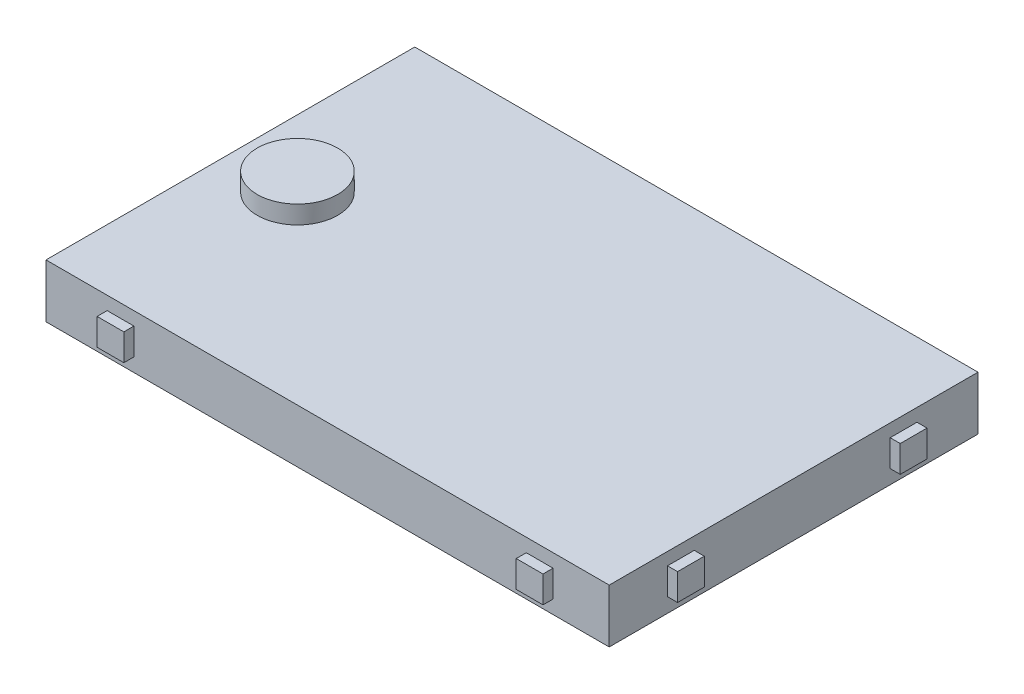
ISO-10303-21;
HEADER;
FILE_DESCRIPTION(('STEP AP214'),'2;1');
FILE_NAME('part.step','',(''),(''),'','','');
FILE_SCHEMA(('AUTOMOTIVE_DESIGN { 1 0 10303 214 1 1 1 1 }'));
ENDSEC;
DATA;
#1=APPLICATION_CONTEXT('core data for automotive mechanical design processes');
#2=APPLICATION_PROTOCOL_DEFINITION('international standard','automotive_design',2000,#1);
#3=PRODUCT_CONTEXT('',#1,'mechanical');
#4=PRODUCT('Part','Part','',(#3));
#5=PRODUCT_RELATED_PRODUCT_CATEGORY('part','',(#4));
#6=PRODUCT_DEFINITION_FORMATION('','',#4);
#7=PRODUCT_DEFINITION_CONTEXT('part definition',#1,'design');
#8=PRODUCT_DEFINITION('design','',#6,#7);
#9=PRODUCT_DEFINITION_SHAPE('','',#8);
#10=(LENGTH_UNIT() NAMED_UNIT(*) SI_UNIT(.MILLI.,.METRE.));
#11=(NAMED_UNIT(*) PLANE_ANGLE_UNIT() SI_UNIT($,.RADIAN.));
#12=(NAMED_UNIT(*) SI_UNIT($,.STERADIAN.) SOLID_ANGLE_UNIT());
#13=UNCERTAINTY_MEASURE_WITH_UNIT(LENGTH_MEASURE(1.E-05),#10,'distance_accuracy_value','');
#14=(GEOMETRIC_REPRESENTATION_CONTEXT(3) GLOBAL_UNCERTAINTY_ASSIGNED_CONTEXT((#13)) GLOBAL_UNIT_ASSIGNED_CONTEXT((#10,
#11,#12)) REPRESENTATION_CONTEXT('',''));
#15=CARTESIAN_POINT('',(0.,0.,0.));
#16=DIRECTION('',(0.,0.,1.));
#17=DIRECTION('',(1.,0.,0.));
#18=AXIS2_PLACEMENT_3D('',#15,#16,#17);
#19=CARTESIAN_POINT('',(42.,8.,27.5));
#20=DIRECTION('',(-1.,0.,0.));
#21=DIRECTION('',(0.,0.,1.));
#22=AXIS2_PLACEMENT_3D('',#19,#20,#21);
#23=PLANE('',#22);
#24=DIRECTION('',(0.,-1.,0.));
#25=VECTOR('',#24,1.);
#26=CARTESIAN_POINT('',(42.,2.15041551653368,18.8064806718478));
#27=LINE('',#26,#25);
#28=CARTESIAN_POINT('',(42.,6.14041551653368,18.8064806718478));
#29=VERTEX_POINT('',#28);
#30=CARTESIAN_POINT('',(42.,2.15041551653368,18.8064806718478));
#31=VERTEX_POINT('',#30);
#32=EDGE_CURVE('E204',#29,#31,#27,.T.);
#33=ORIENTED_EDGE('',*,*,#32,.F.);
#34=DIRECTION('',(0.,0.,1.));
#35=VECTOR('',#34,1.);
#36=CARTESIAN_POINT('',(42.,6.14041551653368,14.8164806718478));
#37=LINE('',#36,#35);
#38=CARTESIAN_POINT('',(42.,6.14041551653368,14.8164806718478));
#39=VERTEX_POINT('',#38);
#40=EDGE_CURVE('E220',#39,#29,#37,.T.);
#41=ORIENTED_EDGE('',*,*,#40,.F.);
#42=DIRECTION('',(0.,1.,0.));
#43=VECTOR('',#42,1.);
#44=CARTESIAN_POINT('',(42.,2.15041551653368,14.8164806718478));
#45=LINE('',#44,#43);
#46=CARTESIAN_POINT('',(42.,2.15041551653368,14.8164806718478));
#47=VERTEX_POINT('',#46);
#48=EDGE_CURVE('E233',#47,#39,#45,.T.);
#49=ORIENTED_EDGE('',*,*,#48,.F.);
#50=DIRECTION('',(0.,0.,-1.));
#51=VECTOR('',#50,1.);
#52=CARTESIAN_POINT('',(42.,2.15041551653368,14.8164806718478));
#53=LINE('',#52,#51);
#54=EDGE_CURVE('E209',#31,#47,#53,.T.);
#55=ORIENTED_EDGE('',*,*,#54,.F.);
#56=EDGE_LOOP('',(#33,#41,#49,#55));
#57=FACE_BOUND('',#56,.T.);
#58=DIRECTION('',(0.,0.,-1.));
#59=VECTOR('',#58,1.);
#60=CARTESIAN_POINT('',(42.,0.,27.5));
#61=LINE('',#60,#59);
#62=CARTESIAN_POINT('',(42.,0.,27.5));
#63=VERTEX_POINT('',#62);
#64=CARTESIAN_POINT('',(42.,0.,-27.5));
#65=VERTEX_POINT('',#64);
#66=EDGE_CURVE('E345',#63,#65,#61,.T.);
#67=ORIENTED_EDGE('',*,*,#66,.T.);
#68=DIRECTION('',(0.,-1.,0.));
#69=VECTOR('',#68,1.);
#70=CARTESIAN_POINT('',(42.,8.,-27.5));
#71=LINE('',#70,#69);
#72=CARTESIAN_POINT('',(42.,8.,-27.5));
#73=VERTEX_POINT('',#72);
#74=EDGE_CURVE('E51',#73,#65,#71,.T.);
#75=ORIENTED_EDGE('',*,*,#74,.F.);
#76=DIRECTION('',(0.,0.,-1.));
#77=VECTOR('',#76,1.);
#78=CARTESIAN_POINT('',(42.,8.,27.5));
#79=LINE('',#78,#77);
#80=CARTESIAN_POINT('',(42.,8.,27.5));
#81=VERTEX_POINT('',#80);
#82=EDGE_CURVE('E346',#81,#73,#79,.T.);
#83=ORIENTED_EDGE('',*,*,#82,.F.);
#84=DIRECTION('',(0.,-1.,0.));
#85=VECTOR('',#84,1.);
#86=CARTESIAN_POINT('',(42.,8.,27.5));
#87=LINE('',#86,#85);
#88=EDGE_CURVE('E360',#81,#63,#87,.T.);
#89=ORIENTED_EDGE('',*,*,#88,.T.);
#90=EDGE_LOOP('',(#67,#75,#83,#89));
#91=FACE_BOUND('',#90,.T.);
#92=DIRECTION('',(0.,-1.,0.));
#93=VECTOR('',#92,1.);
#94=CARTESIAN_POINT('',(42.,2.09309308210614,-14.4034824494288));
#95=LINE('',#94,#93);
#96=CARTESIAN_POINT('',(42.,6.08309308210614,-14.4034824494288));
#97=VERTEX_POINT('',#96);
#98=CARTESIAN_POINT('',(42.,2.09309308210614,-14.4034824494288));
#99=VERTEX_POINT('',#98);
#100=EDGE_CURVE('E202',#97,#99,#95,.T.);
#101=ORIENTED_EDGE('',*,*,#100,.F.);
#102=DIRECTION('',(0.,0.,1.));
#103=VECTOR('',#102,1.);
#104=CARTESIAN_POINT('',(42.,6.08309308210614,-18.3934824494288));
#105=LINE('',#104,#103);
#106=CARTESIAN_POINT('',(42.,6.08309308210614,-18.3934824494288));
#107=VERTEX_POINT('',#106);
#108=EDGE_CURVE('E199',#107,#97,#105,.T.);
#109=ORIENTED_EDGE('',*,*,#108,.F.);
#110=DIRECTION('',(0.,1.,0.));
#111=VECTOR('',#110,1.);
#112=CARTESIAN_POINT('',(42.,2.09309308210614,-18.3934824494288));
#113=LINE('',#112,#111);
#114=CARTESIAN_POINT('',(42.,2.09309308210614,-18.3934824494288));
#115=VERTEX_POINT('',#114);
#116=EDGE_CURVE('E63',#115,#107,#113,.T.);
#117=ORIENTED_EDGE('',*,*,#116,.F.);
#118=DIRECTION('',(0.,0.,-1.));
#119=VECTOR('',#118,1.);
#120=CARTESIAN_POINT('',(42.,2.09309308210614,-18.3934824494288));
#121=LINE('',#120,#119);
#122=EDGE_CURVE('E58',#99,#115,#121,.T.);
#123=ORIENTED_EDGE('',*,*,#122,.F.);
#124=EDGE_LOOP('',(#101,#109,#117,#123));
#125=FACE_BOUND('',#124,.T.);
#126=ADVANCED_FACE('F43',(#57,#91,#125),#23,.F.);
#127=CARTESIAN_POINT('',(-42.,8.,27.5));
#128=DIRECTION('',(0.,0.,-1.));
#129=DIRECTION('',(-1.,0.,0.));
#130=AXIS2_PLACEMENT_3D('',#127,#128,#129);
#131=PLANE('',#130);
#132=DIRECTION('',(0.,-1.,0.));
#133=VECTOR('',#132,1.);
#134=CARTESIAN_POINT('',(-32.8782129241059,2.02252596258467,27.5));
#135=LINE('',#134,#133);
#136=CARTESIAN_POINT('',(-32.8782129241059,6.00979932485183,27.5));
#137=VERTEX_POINT('',#136);
#138=CARTESIAN_POINT('',(-32.8782129241059,2.02252596258467,27.5));
#139=VERTEX_POINT('',#138);
#140=EDGE_CURVE('E300',#137,#139,#135,.T.);
#141=ORIENTED_EDGE('',*,*,#140,.F.);
#142=DIRECTION('',(-1.,0.,0.));
#143=VECTOR('',#142,1.);
#144=CARTESIAN_POINT('',(-28.8909395618387,6.00979932485183,27.5));
#145=LINE('',#144,#143);
#146=CARTESIAN_POINT('',(-28.8909395618387,6.00979932485183,27.5));
#147=VERTEX_POINT('',#146);
#148=EDGE_CURVE('E306',#147,#137,#145,.T.);
#149=ORIENTED_EDGE('',*,*,#148,.F.);
#150=DIRECTION('',(0.,1.,0.));
#151=VECTOR('',#150,1.);
#152=CARTESIAN_POINT('',(-28.8909395618387,2.02252596258467,27.5));
#153=LINE('',#152,#151);
#154=CARTESIAN_POINT('',(-28.8909395618387,2.02252596258467,27.5));
#155=VERTEX_POINT('',#154);
#156=EDGE_CURVE('E323',#155,#147,#153,.T.);
#157=ORIENTED_EDGE('',*,*,#156,.F.);
#158=DIRECTION('',(1.,0.,0.));
#159=VECTOR('',#158,1.);
#160=CARTESIAN_POINT('',(-28.8909395618387,2.02252596258467,27.5));
#161=LINE('',#160,#159);
#162=EDGE_CURVE('E319',#139,#155,#161,.T.);
#163=ORIENTED_EDGE('',*,*,#162,.F.);
#164=EDGE_LOOP('',(#141,#149,#157,#163));
#165=FACE_BOUND('',#164,.T.);
#166=DIRECTION('',(1.,0.,0.));
#167=VECTOR('',#166,1.);
#168=CARTESIAN_POINT('',(-42.,0.,27.5));
#169=LINE('',#168,#167);
#170=CARTESIAN_POINT('',(-42.,0.,27.5));
#171=VERTEX_POINT('',#170);
#172=EDGE_CURVE('E351',#171,#63,#169,.T.);
#173=ORIENTED_EDGE('',*,*,#172,.T.);
#174=ORIENTED_EDGE('',*,*,#88,.F.);
#175=DIRECTION('',(1.,0.,0.));
#176=VECTOR('',#175,1.);
#177=CARTESIAN_POINT('',(-42.,8.,27.5));
#178=LINE('',#177,#176);
#179=CARTESIAN_POINT('',(-42.,8.,27.5));
#180=VERTEX_POINT('',#179);
#181=EDGE_CURVE('E357',#180,#81,#178,.T.);
#182=ORIENTED_EDGE('',*,*,#181,.F.);
#183=DIRECTION('',(0.,-1.,0.));
#184=VECTOR('',#183,1.);
#185=CARTESIAN_POINT('',(-42.,8.,27.5));
#186=LINE('',#185,#184);
#187=EDGE_CURVE('E375',#180,#171,#186,.T.);
#188=ORIENTED_EDGE('',*,*,#187,.T.);
#189=EDGE_LOOP('',(#173,#174,#182,#188));
#190=FACE_BOUND('',#189,.T.);
#191=DIRECTION('',(0.,-1.,0.));
#192=VECTOR('',#191,1.);
#193=CARTESIAN_POINT('',(29.6326906695763,2.00394113546741,27.5));
#194=LINE('',#193,#192);
#195=CARTESIAN_POINT('',(29.6326906695763,5.99394113546741,27.5));
#196=VERTEX_POINT('',#195);
#197=CARTESIAN_POINT('',(29.6326906695763,2.00394113546741,27.5));
#198=VERTEX_POINT('',#197);
#199=EDGE_CURVE('E255',#196,#198,#194,.T.);
#200=ORIENTED_EDGE('',*,*,#199,.F.);
#201=DIRECTION('',(-1.,0.,0.));
#202=VECTOR('',#201,1.);
#203=CARTESIAN_POINT('',(33.6226906695763,5.99394113546741,27.5));
#204=LINE('',#203,#202);
#205=CARTESIAN_POINT('',(33.6226906695763,5.99394113546741,27.5));
#206=VERTEX_POINT('',#205);
#207=EDGE_CURVE('E261',#206,#196,#204,.T.);
#208=ORIENTED_EDGE('',*,*,#207,.F.);
#209=DIRECTION('',(0.,1.,0.));
#210=VECTOR('',#209,1.);
#211=CARTESIAN_POINT('',(33.6226906695763,2.00394113546741,27.5));
#212=LINE('',#211,#210);
#213=CARTESIAN_POINT('',(33.6226906695763,2.00394113546741,27.5));
#214=VERTEX_POINT('',#213);
#215=EDGE_CURVE('E278',#214,#206,#212,.T.);
#216=ORIENTED_EDGE('',*,*,#215,.F.);
#217=DIRECTION('',(1.,0.,0.));
#218=VECTOR('',#217,1.);
#219=CARTESIAN_POINT('',(33.6226906695763,2.00394113546741,27.5));
#220=LINE('',#219,#218);
#221=EDGE_CURVE('E274',#198,#214,#220,.T.);
#222=ORIENTED_EDGE('',*,*,#221,.F.);
#223=EDGE_LOOP('',(#200,#208,#216,#222));
#224=FACE_BOUND('',#223,.T.);
#225=ADVANCED_FACE('F402',(#165,#190,#224),#131,.F.);
#226=CARTESIAN_POINT('',(-42.,8.,-27.5));
#227=DIRECTION('',(0.,0.,1.));
#228=DIRECTION('',(1.,0.,0.));
#229=AXIS2_PLACEMENT_3D('',#226,#227,#228);
#230=PLANE('',#229);
#231=DIRECTION('',(-1.,0.,0.));
#232=VECTOR('',#231,1.);
#233=CARTESIAN_POINT('',(-42.,0.,-27.5));
#234=LINE('',#233,#232);
#235=CARTESIAN_POINT('',(-42.,0.,-27.5));
#236=VERTEX_POINT('',#235);
#237=EDGE_CURVE('E364',#65,#236,#234,.T.);
#238=ORIENTED_EDGE('',*,*,#237,.T.);
#239=DIRECTION('',(0.,-1.,0.));
#240=VECTOR('',#239,1.);
#241=CARTESIAN_POINT('',(-42.,8.,-27.5));
#242=LINE('',#241,#240);
#243=CARTESIAN_POINT('',(-42.,8.,-27.5));
#244=VERTEX_POINT('',#243);
#245=EDGE_CURVE('E379',#244,#236,#242,.T.);
#246=ORIENTED_EDGE('',*,*,#245,.F.);
#247=DIRECTION('',(-1.,0.,0.));
#248=VECTOR('',#247,1.);
#249=CARTESIAN_POINT('',(-42.,8.,-27.5));
#250=LINE('',#249,#248);
#251=EDGE_CURVE('E350',#73,#244,#250,.T.);
#252=ORIENTED_EDGE('',*,*,#251,.F.);
#253=ORIENTED_EDGE('',*,*,#74,.T.);
#254=EDGE_LOOP('',(#238,#246,#252,#253));
#255=FACE_BOUND('',#254,.T.);
#256=ADVANCED_FACE('F386',(#255),#230,.F.);
#257=CARTESIAN_POINT('',(-42.,8.,27.5));
#258=DIRECTION('',(1.,0.,0.));
#259=DIRECTION('',(0.,0.,-1.));
#260=AXIS2_PLACEMENT_3D('',#257,#258,#259);
#261=PLANE('',#260);
#262=DIRECTION('',(0.,0.,1.));
#263=VECTOR('',#262,1.);
#264=CARTESIAN_POINT('',(-42.,0.,27.5));
#265=LINE('',#264,#263);
#266=EDGE_CURVE('E367',#236,#171,#265,.T.);
#267=ORIENTED_EDGE('',*,*,#266,.T.);
#268=ORIENTED_EDGE('',*,*,#187,.F.);
#269=DIRECTION('',(0.,0.,1.));
#270=VECTOR('',#269,1.);
#271=CARTESIAN_POINT('',(-42.,8.,27.5));
#272=LINE('',#271,#270);
#273=EDGE_CURVE('E354',#244,#180,#272,.T.);
#274=ORIENTED_EDGE('',*,*,#273,.F.);
#275=ORIENTED_EDGE('',*,*,#245,.T.);
#276=EDGE_LOOP('',(#267,#268,#274,#275));
#277=FACE_BOUND('',#276,.T.);
#278=ADVANCED_FACE('F398',(#277),#261,.F.);
#279=CARTESIAN_POINT('',(0.,8.,0.));
#280=DIRECTION('',(0.,-1.,0.));
#281=DIRECTION('',(0.,0.,-1.));
#282=AXIS2_PLACEMENT_3D('',#279,#280,#281);
#283=PLANE('',#282);
#284=CARTESIAN_POINT('',(-32.,8.,0.));
#285=DIRECTION('',(0.,-1.,0.));
#286=DIRECTION('',(0.,0.,-1.));
#287=AXIS2_PLACEMENT_3D('',#284,#285,#286);
#288=CIRCLE('',#287,6.);
#289=CARTESIAN_POINT('',(-32.,8.,-6.));
#290=VERTEX_POINT('',#289);
#291=EDGE_CURVE('E11',#290,#290,#288,.F.);
#292=ORIENTED_EDGE('',*,*,#291,.F.);
#293=EDGE_LOOP('',(#292));
#294=FACE_BOUND('',#293,.T.);
#295=ORIENTED_EDGE('',*,*,#82,.T.);
#296=ORIENTED_EDGE('',*,*,#251,.T.);
#297=ORIENTED_EDGE('',*,*,#273,.T.);
#298=ORIENTED_EDGE('',*,*,#181,.T.);
#299=EDGE_LOOP('',(#295,#296,#297,#298));
#300=FACE_BOUND('',#299,.T.);
#301=ADVANCED_FACE('F405',(#294,#300),#283,.F.);
#302=CARTESIAN_POINT('',(0.,0.,0.));
#303=DIRECTION('',(0.,-1.,0.));
#304=DIRECTION('',(0.,0.,-1.));
#305=AXIS2_PLACEMENT_3D('',#302,#303,#304);
#306=PLANE('',#305);
#307=ORIENTED_EDGE('',*,*,#66,.F.);
#308=ORIENTED_EDGE('',*,*,#172,.F.);
#309=ORIENTED_EDGE('',*,*,#266,.F.);
#310=ORIENTED_EDGE('',*,*,#237,.F.);
#311=EDGE_LOOP('',(#307,#308,#309,#310));
#312=FACE_BOUND('',#311,.T.);
#313=ADVANCED_FACE('F394',(#312),#306,.T.);
#314=CARTESIAN_POINT('',(-32.8782129241059,2.02252596258467,29.));
#315=DIRECTION('',(1.,0.,0.));
#316=DIRECTION('',(0.,0.,-1.));
#317=AXIS2_PLACEMENT_3D('',#314,#315,#316);
#318=PLANE('',#317);
#319=ORIENTED_EDGE('',*,*,#140,.T.);
#320=DIRECTION('',(0.,0.,-1.));
#321=VECTOR('',#320,1.);
#322=CARTESIAN_POINT('',(-32.8782129241059,2.02252596258467,29.));
#323=LINE('',#322,#321);
#324=CARTESIAN_POINT('',(-32.8782129241059,2.02252596258467,29.));
#325=VERTEX_POINT('',#324);
#326=EDGE_CURVE('E341',#325,#139,#323,.T.);
#327=ORIENTED_EDGE('',*,*,#326,.F.);
#328=DIRECTION('',(0.,-1.,0.));
#329=VECTOR('',#328,1.);
#330=CARTESIAN_POINT('',(-32.8782129241059,2.02252596258467,29.));
#331=LINE('',#330,#329);
#332=CARTESIAN_POINT('',(-32.8782129241059,6.00979932485183,29.));
#333=VERTEX_POINT('',#332);
#334=EDGE_CURVE('E301',#333,#325,#331,.T.);
#335=ORIENTED_EDGE('',*,*,#334,.F.);
#336=DIRECTION('',(0.,0.,-1.));
#337=VECTOR('',#336,1.);
#338=CARTESIAN_POINT('',(-32.8782129241059,6.00979932485183,29.));
#339=LINE('',#338,#337);
#340=EDGE_CURVE('E315',#333,#137,#339,.T.);
#341=ORIENTED_EDGE('',*,*,#340,.T.);
#342=EDGE_LOOP('',(#319,#327,#335,#341));
#343=FACE_BOUND('',#342,.T.);
#344=ADVANCED_FACE('F414',(#343),#318,.F.);
#345=CARTESIAN_POINT('',(-28.8909395618387,2.02252596258467,29.));
#346=DIRECTION('',(0.,1.,0.));
#347=DIRECTION('',(-1.,0.,0.));
#348=AXIS2_PLACEMENT_3D('',#345,#346,#347);
#349=PLANE('',#348);
#350=ORIENTED_EDGE('',*,*,#162,.T.);
#351=DIRECTION('',(0.,0.,-1.));
#352=VECTOR('',#351,1.);
#353=CARTESIAN_POINT('',(-28.8909395618387,2.02252596258467,29.));
#354=LINE('',#353,#352);
#355=CARTESIAN_POINT('',(-28.8909395618387,2.02252596258467,29.));
#356=VERTEX_POINT('',#355);
#357=EDGE_CURVE('E337',#356,#155,#354,.T.);
#358=ORIENTED_EDGE('',*,*,#357,.F.);
#359=DIRECTION('',(1.,0.,0.));
#360=VECTOR('',#359,1.);
#361=CARTESIAN_POINT('',(-28.8909395618387,2.02252596258467,29.));
#362=LINE('',#361,#360);
#363=EDGE_CURVE('E305',#325,#356,#362,.T.);
#364=ORIENTED_EDGE('',*,*,#363,.F.);
#365=ORIENTED_EDGE('',*,*,#326,.T.);
#366=EDGE_LOOP('',(#350,#358,#364,#365));
#367=FACE_BOUND('',#366,.T.);
#368=ADVANCED_FACE('F485',(#367),#349,.F.);
#369=CARTESIAN_POINT('',(-28.8909395618387,2.02252596258467,29.));
#370=DIRECTION('',(-1.,0.,0.));
#371=DIRECTION('',(0.,0.,1.));
#372=AXIS2_PLACEMENT_3D('',#369,#370,#371);
#373=PLANE('',#372);
#374=ORIENTED_EDGE('',*,*,#156,.T.);
#375=DIRECTION('',(0.,0.,-1.));
#376=VECTOR('',#375,1.);
#377=CARTESIAN_POINT('',(-28.8909395618387,6.00979932485183,29.));
#378=LINE('',#377,#376);
#379=CARTESIAN_POINT('',(-28.8909395618387,6.00979932485183,29.));
#380=VERTEX_POINT('',#379);
#381=EDGE_CURVE('E333',#380,#147,#378,.T.);
#382=ORIENTED_EDGE('',*,*,#381,.F.);
#383=DIRECTION('',(0.,1.,0.));
#384=VECTOR('',#383,1.);
#385=CARTESIAN_POINT('',(-28.8909395618387,2.02252596258467,29.));
#386=LINE('',#385,#384);
#387=EDGE_CURVE('E309',#356,#380,#386,.T.);
#388=ORIENTED_EDGE('',*,*,#387,.F.);
#389=ORIENTED_EDGE('',*,*,#357,.T.);
#390=EDGE_LOOP('',(#374,#382,#388,#389));
#391=FACE_BOUND('',#390,.T.);
#392=ADVANCED_FACE('F481',(#391),#373,.F.);
#393=CARTESIAN_POINT('',(-28.8909395618387,6.00979932485183,29.));
#394=DIRECTION('',(0.,-1.,0.));
#395=DIRECTION('',(1.,0.,0.));
#396=AXIS2_PLACEMENT_3D('',#393,#394,#395);
#397=PLANE('',#396);
#398=ORIENTED_EDGE('',*,*,#148,.T.);
#399=ORIENTED_EDGE('',*,*,#340,.F.);
#400=DIRECTION('',(-1.,0.,0.));
#401=VECTOR('',#400,1.);
#402=CARTESIAN_POINT('',(-28.8909395618387,6.00979932485183,29.));
#403=LINE('',#402,#401);
#404=EDGE_CURVE('E312',#380,#333,#403,.T.);
#405=ORIENTED_EDGE('',*,*,#404,.F.);
#406=ORIENTED_EDGE('',*,*,#381,.T.);
#407=EDGE_LOOP('',(#398,#399,#405,#406));
#408=FACE_BOUND('',#407,.T.);
#409=ADVANCED_FACE('F477',(#408),#397,.F.);
#410=CARTESIAN_POINT('',(0.,0.,29.));
#411=DIRECTION('',(0.,0.,1.));
#412=DIRECTION('',(1.,0.,0.));
#413=AXIS2_PLACEMENT_3D('',#410,#411,#412);
#414=PLANE('',#413);
#415=ORIENTED_EDGE('',*,*,#334,.T.);
#416=ORIENTED_EDGE('',*,*,#363,.T.);
#417=ORIENTED_EDGE('',*,*,#387,.T.);
#418=ORIENTED_EDGE('',*,*,#404,.T.);
#419=EDGE_LOOP('',(#415,#416,#417,#418));
#420=FACE_BOUND('',#419,.T.);
#421=ADVANCED_FACE('F473',(#420),#414,.T.);
#422=CARTESIAN_POINT('',(29.6326906695763,2.00394113546741,29.));
#423=DIRECTION('',(1.,0.,0.));
#424=DIRECTION('',(0.,0.,-1.));
#425=AXIS2_PLACEMENT_3D('',#422,#423,#424);
#426=PLANE('',#425);
#427=ORIENTED_EDGE('',*,*,#199,.T.);
#428=DIRECTION('',(0.,0.,-1.));
#429=VECTOR('',#428,1.);
#430=CARTESIAN_POINT('',(29.6326906695763,2.00394113546741,29.));
#431=LINE('',#430,#429);
#432=CARTESIAN_POINT('',(29.6326906695763,2.00394113546741,29.));
#433=VERTEX_POINT('',#432);
#434=EDGE_CURVE('E296',#433,#198,#431,.T.);
#435=ORIENTED_EDGE('',*,*,#434,.F.);
#436=DIRECTION('',(0.,-1.,0.));
#437=VECTOR('',#436,1.);
#438=CARTESIAN_POINT('',(29.6326906695763,2.00394113546741,29.));
#439=LINE('',#438,#437);
#440=CARTESIAN_POINT('',(29.6326906695763,5.99394113546741,29.));
#441=VERTEX_POINT('',#440);
#442=EDGE_CURVE('E256',#441,#433,#439,.T.);
#443=ORIENTED_EDGE('',*,*,#442,.F.);
#444=DIRECTION('',(0.,0.,-1.));
#445=VECTOR('',#444,1.);
#446=CARTESIAN_POINT('',(29.6326906695763,5.99394113546741,29.));
#447=LINE('',#446,#445);
#448=EDGE_CURVE('E270',#441,#196,#447,.T.);
#449=ORIENTED_EDGE('',*,*,#448,.T.);
#450=EDGE_LOOP('',(#427,#435,#443,#449));
#451=FACE_BOUND('',#450,.T.);
#452=ADVANCED_FACE('F469',(#451),#426,.F.);
#453=CARTESIAN_POINT('',(33.6226906695763,2.00394113546741,29.));
#454=DIRECTION('',(0.,1.,0.));
#455=DIRECTION('',(0.,0.,1.));
#456=AXIS2_PLACEMENT_3D('',#453,#454,#455);
#457=PLANE('',#456);
#458=ORIENTED_EDGE('',*,*,#221,.T.);
#459=DIRECTION('',(0.,0.,-1.));
#460=VECTOR('',#459,1.);
#461=CARTESIAN_POINT('',(33.6226906695763,2.00394113546741,29.));
#462=LINE('',#461,#460);
#463=CARTESIAN_POINT('',(33.6226906695763,2.00394113546741,29.));
#464=VERTEX_POINT('',#463);
#465=EDGE_CURVE('E292',#464,#214,#462,.T.);
#466=ORIENTED_EDGE('',*,*,#465,.F.);
#467=DIRECTION('',(1.,0.,0.));
#468=VECTOR('',#467,1.);
#469=CARTESIAN_POINT('',(33.6226906695763,2.00394113546741,29.));
#470=LINE('',#469,#468);
#471=EDGE_CURVE('E260',#433,#464,#470,.T.);
#472=ORIENTED_EDGE('',*,*,#471,.F.);
#473=ORIENTED_EDGE('',*,*,#434,.T.);
#474=EDGE_LOOP('',(#458,#466,#472,#473));
#475=FACE_BOUND('',#474,.T.);
#476=ADVANCED_FACE('F465',(#475),#457,.F.);
#477=CARTESIAN_POINT('',(33.6226906695763,2.00394113546741,29.));
#478=DIRECTION('',(-1.,0.,0.));
#479=DIRECTION('',(0.,-1.,0.));
#480=AXIS2_PLACEMENT_3D('',#477,#478,#479);
#481=PLANE('',#480);
#482=ORIENTED_EDGE('',*,*,#215,.T.);
#483=DIRECTION('',(0.,0.,-1.));
#484=VECTOR('',#483,1.);
#485=CARTESIAN_POINT('',(33.6226906695763,5.99394113546741,29.));
#486=LINE('',#485,#484);
#487=CARTESIAN_POINT('',(33.6226906695763,5.99394113546741,29.));
#488=VERTEX_POINT('',#487);
#489=EDGE_CURVE('E288',#488,#206,#486,.T.);
#490=ORIENTED_EDGE('',*,*,#489,.F.);
#491=DIRECTION('',(0.,1.,0.));
#492=VECTOR('',#491,1.);
#493=CARTESIAN_POINT('',(33.6226906695763,2.00394113546741,29.));
#494=LINE('',#493,#492);
#495=EDGE_CURVE('E264',#464,#488,#494,.T.);
#496=ORIENTED_EDGE('',*,*,#495,.F.);
#497=ORIENTED_EDGE('',*,*,#465,.T.);
#498=EDGE_LOOP('',(#482,#490,#496,#497));
#499=FACE_BOUND('',#498,.T.);
#500=ADVANCED_FACE('F461',(#499),#481,.F.);
#501=CARTESIAN_POINT('',(33.6226906695763,5.99394113546741,29.));
#502=DIRECTION('',(0.,-1.,0.));
#503=DIRECTION('',(0.,0.,-1.));
#504=AXIS2_PLACEMENT_3D('',#501,#502,#503);
#505=PLANE('',#504);
#506=ORIENTED_EDGE('',*,*,#207,.T.);
#507=ORIENTED_EDGE('',*,*,#448,.F.);
#508=DIRECTION('',(-1.,0.,0.));
#509=VECTOR('',#508,1.);
#510=CARTESIAN_POINT('',(33.6226906695763,5.99394113546741,29.));
#511=LINE('',#510,#509);
#512=EDGE_CURVE('E267',#488,#441,#511,.T.);
#513=ORIENTED_EDGE('',*,*,#512,.F.);
#514=ORIENTED_EDGE('',*,*,#489,.T.);
#515=EDGE_LOOP('',(#506,#507,#513,#514));
#516=FACE_BOUND('',#515,.T.);
#517=ADVANCED_FACE('F457',(#516),#505,.F.);
#518=CARTESIAN_POINT('',(0.,0.,29.));
#519=DIRECTION('',(0.,0.,1.));
#520=DIRECTION('',(1.,0.,0.));
#521=AXIS2_PLACEMENT_3D('',#518,#519,#520);
#522=PLANE('',#521);
#523=ORIENTED_EDGE('',*,*,#442,.T.);
#524=ORIENTED_EDGE('',*,*,#471,.T.);
#525=ORIENTED_EDGE('',*,*,#495,.T.);
#526=ORIENTED_EDGE('',*,*,#512,.T.);
#527=EDGE_LOOP('',(#523,#524,#525,#526));
#528=FACE_BOUND('',#527,.T.);
#529=ADVANCED_FACE('F451',(#528),#522,.T.);
#530=CARTESIAN_POINT('',(43.5,2.15041551653368,18.8064806718478));
#531=DIRECTION('',(0.,0.,-1.));
#532=DIRECTION('',(-1.,0.,0.));
#533=AXIS2_PLACEMENT_3D('',#530,#531,#532);
#534=PLANE('',#533);
#535=ORIENTED_EDGE('',*,*,#32,.T.);
#536=DIRECTION('',(-1.,0.,0.));
#537=VECTOR('',#536,1.);
#538=CARTESIAN_POINT('',(43.5,2.15041551653368,18.8064806718478));
#539=LINE('',#538,#537);
#540=CARTESIAN_POINT('',(43.5,2.15041551653368,18.8064806718478));
#541=VERTEX_POINT('',#540);
#542=EDGE_CURVE('E251',#541,#31,#539,.T.);
#543=ORIENTED_EDGE('',*,*,#542,.F.);
#544=DIRECTION('',(0.,-1.,0.));
#545=VECTOR('',#544,1.);
#546=CARTESIAN_POINT('',(43.5,2.15041551653368,18.8064806718478));
#547=LINE('',#546,#545);
#548=CARTESIAN_POINT('',(43.5,6.14041551653368,18.8064806718478));
#549=VERTEX_POINT('',#548);
#550=EDGE_CURVE('E215',#549,#541,#547,.T.);
#551=ORIENTED_EDGE('',*,*,#550,.F.);
#552=DIRECTION('',(-1.,0.,0.));
#553=VECTOR('',#552,1.);
#554=CARTESIAN_POINT('',(43.5,6.14041551653368,18.8064806718478));
#555=LINE('',#554,#553);
#556=EDGE_CURVE('E228',#549,#29,#555,.T.);
#557=ORIENTED_EDGE('',*,*,#556,.T.);
#558=EDGE_LOOP('',(#535,#543,#551,#557));
#559=FACE_BOUND('',#558,.T.);
#560=ADVANCED_FACE('F435',(#559),#534,.F.);
#561=CARTESIAN_POINT('',(43.5,2.15041551653368,14.8164806718478));
#562=DIRECTION('',(0.,1.,0.));
#563=DIRECTION('',(0.,0.,1.));
#564=AXIS2_PLACEMENT_3D('',#561,#562,#563);
#565=PLANE('',#564);
#566=ORIENTED_EDGE('',*,*,#54,.T.);
#567=DIRECTION('',(-1.,0.,0.));
#568=VECTOR('',#567,1.);
#569=CARTESIAN_POINT('',(43.5,2.15041551653368,14.8164806718478));
#570=LINE('',#569,#568);
#571=CARTESIAN_POINT('',(43.5,2.15041551653368,14.8164806718478));
#572=VERTEX_POINT('',#571);
#573=EDGE_CURVE('E247',#572,#47,#570,.T.);
#574=ORIENTED_EDGE('',*,*,#573,.F.);
#575=DIRECTION('',(0.,0.,-1.));
#576=VECTOR('',#575,1.);
#577=CARTESIAN_POINT('',(43.5,2.15041551653368,14.8164806718478));
#578=LINE('',#577,#576);
#579=EDGE_CURVE('E219',#541,#572,#578,.T.);
#580=ORIENTED_EDGE('',*,*,#579,.F.);
#581=ORIENTED_EDGE('',*,*,#542,.T.);
#582=EDGE_LOOP('',(#566,#574,#580,#581));
#583=FACE_BOUND('',#582,.T.);
#584=ADVANCED_FACE('F443',(#583),#565,.F.);
#585=CARTESIAN_POINT('',(43.5,2.15041551653368,14.8164806718478));
#586=DIRECTION('',(0.,0.,1.));
#587=DIRECTION('',(0.,-1.,0.));
#588=AXIS2_PLACEMENT_3D('',#585,#586,#587);
#589=PLANE('',#588);
#590=ORIENTED_EDGE('',*,*,#48,.T.);
#591=DIRECTION('',(-1.,0.,0.));
#592=VECTOR('',#591,1.);
#593=CARTESIAN_POINT('',(43.5,6.14041551653368,14.8164806718478));
#594=LINE('',#593,#592);
#595=CARTESIAN_POINT('',(43.5,6.14041551653368,14.8164806718478));
#596=VERTEX_POINT('',#595);
#597=EDGE_CURVE('E243',#596,#39,#594,.T.);
#598=ORIENTED_EDGE('',*,*,#597,.F.);
#599=DIRECTION('',(0.,1.,0.));
#600=VECTOR('',#599,1.);
#601=CARTESIAN_POINT('',(43.5,2.15041551653368,14.8164806718478));
#602=LINE('',#601,#600);
#603=EDGE_CURVE('E223',#572,#596,#602,.T.);
#604=ORIENTED_EDGE('',*,*,#603,.F.);
#605=ORIENTED_EDGE('',*,*,#573,.T.);
#606=EDGE_LOOP('',(#590,#598,#604,#605));
#607=FACE_BOUND('',#606,.T.);
#608=ADVANCED_FACE('F441',(#607),#589,.F.);
#609=CARTESIAN_POINT('',(43.5,6.14041551653368,14.8164806718478));
#610=DIRECTION('',(0.,-1.,0.));
#611=DIRECTION('',(0.,0.,-1.));
#612=AXIS2_PLACEMENT_3D('',#609,#610,#611);
#613=PLANE('',#612);
#614=ORIENTED_EDGE('',*,*,#40,.T.);
#615=ORIENTED_EDGE('',*,*,#556,.F.);
#616=DIRECTION('',(0.,0.,1.));
#617=VECTOR('',#616,1.);
#618=CARTESIAN_POINT('',(43.5,6.14041551653368,14.8164806718478));
#619=LINE('',#618,#617);
#620=EDGE_CURVE('E226',#596,#549,#619,.T.);
#621=ORIENTED_EDGE('',*,*,#620,.F.);
#622=ORIENTED_EDGE('',*,*,#597,.T.);
#623=EDGE_LOOP('',(#614,#615,#621,#622));
#624=FACE_BOUND('',#623,.T.);
#625=ADVANCED_FACE('F431',(#624),#613,.F.);
#626=CARTESIAN_POINT('',(43.5,0.,0.));
#627=DIRECTION('',(1.,0.,0.));
#628=DIRECTION('',(0.,0.,-1.));
#629=AXIS2_PLACEMENT_3D('',#626,#627,#628);
#630=PLANE('',#629);
#631=ORIENTED_EDGE('',*,*,#550,.T.);
#632=ORIENTED_EDGE('',*,*,#579,.T.);
#633=ORIENTED_EDGE('',*,*,#603,.T.);
#634=ORIENTED_EDGE('',*,*,#620,.T.);
#635=EDGE_LOOP('',(#631,#632,#633,#634));
#636=FACE_BOUND('',#635,.T.);
#637=ADVANCED_FACE('F437',(#636),#630,.T.);
#638=CARTESIAN_POINT('',(43.5,2.09309308210614,-14.4034824494288));
#639=DIRECTION('',(0.,0.,-1.));
#640=DIRECTION('',(-1.,0.,0.));
#641=AXIS2_PLACEMENT_3D('',#638,#639,#640);
#642=PLANE('',#641);
#643=ORIENTED_EDGE('',*,*,#100,.T.);
#644=DIRECTION('',(-1.,0.,0.));
#645=VECTOR('',#644,1.);
#646=CARTESIAN_POINT('',(43.5,2.09309308210614,-14.4034824494288));
#647=LINE('',#646,#645);
#648=CARTESIAN_POINT('',(43.5,2.09309308210614,-14.4034824494288));
#649=VERTEX_POINT('',#648);
#650=EDGE_CURVE('E181',#649,#99,#647,.T.);
#651=ORIENTED_EDGE('',*,*,#650,.F.);
#652=DIRECTION('',(0.,-1.,0.));
#653=VECTOR('',#652,1.);
#654=CARTESIAN_POINT('',(43.5,2.09309308210614,-14.4034824494288));
#655=LINE('',#654,#653);
#656=CARTESIAN_POINT('',(43.5,6.08309308210614,-14.4034824494288));
#657=VERTEX_POINT('',#656);
#658=EDGE_CURVE('E189',#657,#649,#655,.T.);
#659=ORIENTED_EDGE('',*,*,#658,.F.);
#660=DIRECTION('',(-1.,0.,0.));
#661=VECTOR('',#660,1.);
#662=CARTESIAN_POINT('',(43.5,6.08309308210614,-14.4034824494288));
#663=LINE('',#662,#661);
#664=EDGE_CURVE('E751',#657,#97,#663,.T.);
#665=ORIENTED_EDGE('',*,*,#664,.T.);
#666=EDGE_LOOP('',(#643,#651,#659,#665));
#667=FACE_BOUND('',#666,.T.);
#668=ADVANCED_FACE('F201',(#667),#642,.F.);
#669=CARTESIAN_POINT('',(43.5,2.09309308210614,-18.3934824494288));
#670=DIRECTION('',(0.,1.,0.));
#671=DIRECTION('',(0.,0.,1.));
#672=AXIS2_PLACEMENT_3D('',#669,#670,#671);
#673=PLANE('',#672);
#674=ORIENTED_EDGE('',*,*,#122,.T.);
#675=DIRECTION('',(-1.,0.,0.));
#676=VECTOR('',#675,1.);
#677=CARTESIAN_POINT('',(43.5,2.09309308210614,-18.3934824494288));
#678=LINE('',#677,#676);
#679=CARTESIAN_POINT('',(43.5,2.09309308210614,-18.3934824494288));
#680=VERTEX_POINT('',#679);
#681=EDGE_CURVE('E184',#680,#115,#678,.T.);
#682=ORIENTED_EDGE('',*,*,#681,.F.);
#683=DIRECTION('',(0.,0.,-1.));
#684=VECTOR('',#683,1.);
#685=CARTESIAN_POINT('',(43.5,2.09309308210614,-18.3934824494288));
#686=LINE('',#685,#684);
#687=EDGE_CURVE('E177',#649,#680,#686,.T.);
#688=ORIENTED_EDGE('',*,*,#687,.F.);
#689=ORIENTED_EDGE('',*,*,#650,.T.);
#690=EDGE_LOOP('',(#674,#682,#688,#689));
#691=FACE_BOUND('',#690,.T.);
#692=ADVANCED_FACE('F179',(#691),#673,.F.);
#693=CARTESIAN_POINT('',(43.5,2.09309308210614,-18.3934824494288));
#694=DIRECTION('',(0.,0.,1.));
#695=DIRECTION('',(0.,-1.,0.));
#696=AXIS2_PLACEMENT_3D('',#693,#694,#695);
#697=PLANE('',#696);
#698=ORIENTED_EDGE('',*,*,#116,.T.);
#699=DIRECTION('',(-1.,0.,0.));
#700=VECTOR('',#699,1.);
#701=CARTESIAN_POINT('',(43.5,6.08309308210614,-18.3934824494288));
#702=LINE('',#701,#700);
#703=CARTESIAN_POINT('',(43.5,6.08309308210614,-18.3934824494288));
#704=VERTEX_POINT('',#703);
#705=EDGE_CURVE('E211',#704,#107,#702,.T.);
#706=ORIENTED_EDGE('',*,*,#705,.F.);
#707=DIRECTION('',(0.,1.,0.));
#708=VECTOR('',#707,1.);
#709=CARTESIAN_POINT('',(43.5,2.09309308210614,-18.3934824494288));
#710=LINE('',#709,#708);
#711=EDGE_CURVE('E188',#680,#704,#710,.T.);
#712=ORIENTED_EDGE('',*,*,#711,.F.);
#713=ORIENTED_EDGE('',*,*,#681,.T.);
#714=EDGE_LOOP('',(#698,#706,#712,#713));
#715=FACE_BOUND('',#714,.T.);
#716=ADVANCED_FACE('F596',(#715),#697,.F.);
#717=CARTESIAN_POINT('',(43.5,6.08309308210614,-18.3934824494288));
#718=DIRECTION('',(0.,-1.,0.));
#719=DIRECTION('',(0.,0.,-1.));
#720=AXIS2_PLACEMENT_3D('',#717,#718,#719);
#721=PLANE('',#720);
#722=ORIENTED_EDGE('',*,*,#108,.T.);
#723=ORIENTED_EDGE('',*,*,#664,.F.);
#724=DIRECTION('',(0.,0.,1.));
#725=VECTOR('',#724,1.);
#726=CARTESIAN_POINT('',(43.5,6.08309308210614,-18.3934824494288));
#727=LINE('',#726,#725);
#728=EDGE_CURVE('E194',#704,#657,#727,.T.);
#729=ORIENTED_EDGE('',*,*,#728,.F.);
#730=ORIENTED_EDGE('',*,*,#705,.T.);
#731=EDGE_LOOP('',(#722,#723,#729,#730));
#732=FACE_BOUND('',#731,.T.);
#733=ADVANCED_FACE('F606',(#732),#721,.F.);
#734=CARTESIAN_POINT('',(43.5,0.,0.));
#735=DIRECTION('',(1.,0.,0.));
#736=DIRECTION('',(0.,0.,-1.));
#737=AXIS2_PLACEMENT_3D('',#734,#735,#736);
#738=PLANE('',#737);
#739=ORIENTED_EDGE('',*,*,#658,.T.);
#740=ORIENTED_EDGE('',*,*,#687,.T.);
#741=ORIENTED_EDGE('',*,*,#711,.T.);
#742=ORIENTED_EDGE('',*,*,#728,.T.);
#743=EDGE_LOOP('',(#739,#740,#741,#742));
#744=FACE_BOUND('',#743,.T.);
#745=ADVANCED_FACE('F192',(#744),#738,.T.);
#746=CARTESIAN_POINT('',(-32.,10.7,0.));
#747=DIRECTION('',(0.,-1.,0.));
#748=DIRECTION('',(0.,0.,-1.));
#749=AXIS2_PLACEMENT_3D('',#746,#747,#748);
#750=CYLINDRICAL_SURFACE('',#749,6.);
#751=CARTESIAN_POINT('',(-32.,10.7,0.));
#752=DIRECTION('',(0.,1.,0.));
#753=DIRECTION('',(0.,0.,1.));
#754=AXIS2_PLACEMENT_3D('',#751,#752,#753);
#755=CIRCLE('',#754,6.);
#756=CARTESIAN_POINT('',(-32.,10.7,6.));
#757=VERTEX_POINT('',#756);
#758=EDGE_CURVE('E742',#757,#757,#755,.T.);
#759=ORIENTED_EDGE('',*,*,#758,.F.);
#760=EDGE_LOOP('',(#759));
#761=FACE_BOUND('',#760,.T.);
#762=ORIENTED_EDGE('',*,*,#291,.T.);
#763=EDGE_LOOP('',(#762));
#764=FACE_BOUND('',#763,.T.);
#765=ADVANCED_FACE('F625',(#761,#764),#750,.T.);
#766=CARTESIAN_POINT('',(-32.,10.7,0.));
#767=DIRECTION('',(0.,1.,0.));
#768=DIRECTION('',(0.,0.,1.));
#769=AXIS2_PLACEMENT_3D('',#766,#767,#768);
#770=PLANE('',#769);
#771=ORIENTED_EDGE('',*,*,#758,.T.);
#772=EDGE_LOOP('',(#771));
#773=FACE_BOUND('',#772,.T.);
#774=ADVANCED_FACE('F635',(#773),#770,.T.);
#775=CLOSED_SHELL('',(#126,#225,#256,#278,#301,#313,#344,#368,#392,#409,#421,#452,#476,#500,
#517,#529,#560,#584,#608,#625,#637,#668,#692,#716,#733,#745,#765,#774));
#776=MANIFOLD_SOLID_BREP('B2',#775);
#777=ADVANCED_BREP_SHAPE_REPRESENTATION('',(#18,#776),#14);
#778=SHAPE_DEFINITION_REPRESENTATION(#9,#777);
ENDSEC;
END-ISO-10303-21;
